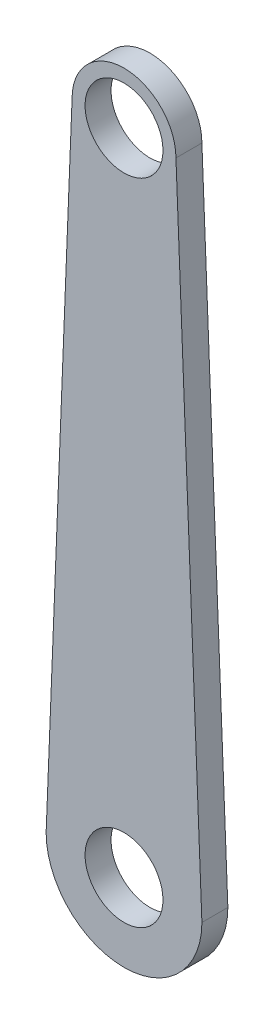
ISO-10303-21;
HEADER;
FILE_DESCRIPTION(('STEP AP214'),'2;1');
FILE_NAME('part.step','',(''),(''),'','','');
FILE_SCHEMA(('AUTOMOTIVE_DESIGN { 1 0 10303 214 1 1 1 1 }'));
ENDSEC;
DATA;
#1=APPLICATION_CONTEXT('core data for automotive mechanical design processes');
#2=APPLICATION_PROTOCOL_DEFINITION('international standard','automotive_design',2000,#1);
#3=PRODUCT_CONTEXT('',#1,'mechanical');
#4=PRODUCT('Part','Part','',(#3));
#5=PRODUCT_RELATED_PRODUCT_CATEGORY('part','',(#4));
#6=PRODUCT_DEFINITION_FORMATION('','',#4);
#7=PRODUCT_DEFINITION_CONTEXT('part definition',#1,'design');
#8=PRODUCT_DEFINITION('design','',#6,#7);
#9=PRODUCT_DEFINITION_SHAPE('','',#8);
#10=(LENGTH_UNIT() NAMED_UNIT(*) SI_UNIT(.MILLI.,.METRE.));
#11=(NAMED_UNIT(*) PLANE_ANGLE_UNIT() SI_UNIT($,.RADIAN.));
#12=(NAMED_UNIT(*) SI_UNIT($,.STERADIAN.) SOLID_ANGLE_UNIT());
#13=UNCERTAINTY_MEASURE_WITH_UNIT(LENGTH_MEASURE(1.E-05),#10,'distance_accuracy_value','');
#14=(GEOMETRIC_REPRESENTATION_CONTEXT(3) GLOBAL_UNCERTAINTY_ASSIGNED_CONTEXT((#13)) GLOBAL_UNIT_ASSIGNED_CONTEXT((#10,
#11,#12)) REPRESENTATION_CONTEXT('',''));
#15=CARTESIAN_POINT('',(0.,0.,0.));
#16=DIRECTION('',(0.,0.,1.));
#17=DIRECTION('',(1.,0.,0.));
#18=AXIS2_PLACEMENT_3D('',#15,#16,#17);
#19=CARTESIAN_POINT('',(8.07772589112119,-0.323109035644848,-2.));
#20=DIRECTION('',(0.999200958721789,-0.0399680383488716,0.));
#21=DIRECTION('',(0.0399680383488716,0.999200958721789,0.));
#22=AXIS2_PLACEMENT_3D('',#19,#20,#21);
#23=PLANE('',#22);
#24=DIRECTION('',(-0.0399680383488716,-0.99920095872179,0.));
#25=VECTOR('',#24,1.);
#26=CARTESIAN_POINT('',(8.07772589112119,-0.323109035644848,0.));
#27=LINE('',#26,#25);
#28=CARTESIAN_POINT('',(8.69089530054577,15.0061261999696,0.));
#29=VERTEX_POINT('',#28);
#30=CARTESIAN_POINT('',(6.69089530054577,-34.9938738000304,0.));
#31=VERTEX_POINT('',#30);
#32=EDGE_CURVE('E111',#29,#31,#27,.T.);
#33=ORIENTED_EDGE('',*,*,#32,.F.);
#34=DIRECTION('',(0.,0.,1.));
#35=VECTOR('',#34,1.);
#36=CARTESIAN_POINT('',(8.69089530054577,15.0061261999696,-2.));
#37=LINE('',#36,#35);
#38=CARTESIAN_POINT('',(8.69089530054577,15.0061261999696,-2.));
#39=VERTEX_POINT('',#38);
#40=EDGE_CURVE('E104',#39,#29,#37,.T.);
#41=ORIENTED_EDGE('',*,*,#40,.F.);
#42=DIRECTION('',(-0.0399680383488716,-0.99920095872179,0.));
#43=VECTOR('',#42,1.);
#44=CARTESIAN_POINT('',(8.07772589112119,-0.323109035644848,-2.));
#45=LINE('',#44,#43);
#46=CARTESIAN_POINT('',(6.69089530054577,-34.9938738000304,-2.));
#47=VERTEX_POINT('',#46);
#48=EDGE_CURVE('E97',#39,#47,#45,.T.);
#49=ORIENTED_EDGE('',*,*,#48,.T.);
#50=DIRECTION('',(0.,0.,1.));
#51=VECTOR('',#50,1.);
#52=CARTESIAN_POINT('',(6.69089530054577,-34.9938738000304,-2.));
#53=LINE('',#52,#51);
#54=EDGE_CURVE('E11',#47,#31,#53,.T.);
#55=ORIENTED_EDGE('',*,*,#54,.T.);
#56=EDGE_LOOP('',(#33,#41,#49,#55));
#57=FACE_BOUND('',#56,.T.);
#58=ADVANCED_FACE('F39',(#57),#23,.F.);
#59=CARTESIAN_POINT('',(12.6908953005458,-34.9938738000304,-2.));
#60=DIRECTION('',(0.,0.,1.));
#61=DIRECTION('',(-1.,0.,0.));
#62=AXIS2_PLACEMENT_3D('',#59,#60,#61);
#63=CYLINDRICAL_SURFACE('',#62,6.);
#64=CARTESIAN_POINT('',(12.6908953005458,-34.9938738000304,0.));
#65=DIRECTION('',(0.,0.,1.));
#66=DIRECTION('',(1.,0.,0.));
#67=AXIS2_PLACEMENT_3D('',#64,#65,#66);
#68=CIRCLE('',#67,6.);
#69=CARTESIAN_POINT('',(18.6908953005458,-34.9938738000304,0.));
#70=VERTEX_POINT('',#69);
#71=EDGE_CURVE('E113',#31,#70,#68,.T.);
#72=ORIENTED_EDGE('',*,*,#71,.F.);
#73=ORIENTED_EDGE('',*,*,#54,.F.);
#74=CARTESIAN_POINT('',(12.6908953005458,-34.9938738000304,-2.));
#75=DIRECTION('',(0.,0.,1.));
#76=DIRECTION('',(1.,0.,0.));
#77=AXIS2_PLACEMENT_3D('',#74,#75,#76);
#78=CIRCLE('',#77,6.);
#79=CARTESIAN_POINT('',(18.6908953005458,-34.9938738000304,-2.));
#80=VERTEX_POINT('',#79);
#81=EDGE_CURVE('E81',#47,#80,#78,.T.);
#82=ORIENTED_EDGE('',*,*,#81,.T.);
#83=DIRECTION('',(0.,0.,1.));
#84=VECTOR('',#83,1.);
#85=CARTESIAN_POINT('',(18.6908953005458,-34.9938738000304,-2.));
#86=LINE('',#85,#84);
#87=EDGE_CURVE('E48',#80,#70,#86,.T.);
#88=ORIENTED_EDGE('',*,*,#87,.T.);
#89=EDGE_LOOP('',(#72,#73,#82,#88));
#90=FACE_BOUND('',#89,.T.);
#91=ADVANCED_FACE('F95',(#90),#63,.T.);
#92=CARTESIAN_POINT('',(17.2635187185948,0.690540748743791,-2.));
#93=DIRECTION('',(0.999200958721789,0.0399680383488715,0.));
#94=DIRECTION('',(-0.0399680383488715,0.999200958721789,0.));
#95=AXIS2_PLACEMENT_3D('',#92,#93,#94);
#96=PLANE('',#95);
#97=DIRECTION('',(0.0399680383488715,-0.99920095872179,0.));
#98=VECTOR('',#97,1.);
#99=CARTESIAN_POINT('',(17.2635187185948,0.690540748743791,0.));
#100=LINE('',#99,#98);
#101=CARTESIAN_POINT('',(16.6908953005458,15.0061261999696,0.));
#102=VERTEX_POINT('',#101);
#103=EDGE_CURVE('E91',#102,#70,#100,.T.);
#104=ORIENTED_EDGE('',*,*,#103,.T.);
#105=ORIENTED_EDGE('',*,*,#87,.F.);
#106=DIRECTION('',(0.0399680383488715,-0.99920095872179,0.));
#107=VECTOR('',#106,1.);
#108=CARTESIAN_POINT('',(17.2635187185948,0.690540748743791,-2.));
#109=LINE('',#108,#107);
#110=CARTESIAN_POINT('',(16.6908953005458,15.0061261999696,-2.));
#111=VERTEX_POINT('',#110);
#112=EDGE_CURVE('E84',#111,#80,#109,.T.);
#113=ORIENTED_EDGE('',*,*,#112,.F.);
#114=DIRECTION('',(0.,0.,1.));
#115=VECTOR('',#114,1.);
#116=CARTESIAN_POINT('',(16.6908953005458,15.0061261999696,-2.));
#117=LINE('',#116,#115);
#118=EDGE_CURVE('E94',#111,#102,#117,.T.);
#119=ORIENTED_EDGE('',*,*,#118,.T.);
#120=EDGE_LOOP('',(#104,#105,#113,#119));
#121=FACE_BOUND('',#120,.T.);
#122=ADVANCED_FACE('F90',(#121),#96,.T.);
#123=CARTESIAN_POINT('',(12.6908953005458,-34.9938738000304,-2.));
#124=DIRECTION('',(0.,0.,1.));
#125=DIRECTION('',(-1.,0.,0.));
#126=AXIS2_PLACEMENT_3D('',#123,#124,#125);
#127=CYLINDRICAL_SURFACE('',#126,3.);
#128=CARTESIAN_POINT('',(12.6908953005458,-34.9938738000304,-2.));
#129=DIRECTION('',(0.,0.,1.));
#130=DIRECTION('',(1.,0.,0.));
#131=AXIS2_PLACEMENT_3D('',#128,#129,#130);
#132=CIRCLE('',#131,3.);
#133=CARTESIAN_POINT('',(15.6908953005458,-34.9938738000304,-2.));
#134=VERTEX_POINT('',#133);
#135=EDGE_CURVE('E99',#134,#134,#132,.T.);
#136=ORIENTED_EDGE('',*,*,#135,.F.);
#137=EDGE_LOOP('',(#136));
#138=FACE_BOUND('',#137,.T.);
#139=CARTESIAN_POINT('',(12.6908953005458,-34.9938738000304,0.));
#140=DIRECTION('',(0.,0.,1.));
#141=DIRECTION('',(1.,0.,0.));
#142=AXIS2_PLACEMENT_3D('',#139,#140,#141);
#143=CIRCLE('',#142,3.);
#144=CARTESIAN_POINT('',(15.6908953005458,-34.9938738000304,0.));
#145=VERTEX_POINT('',#144);
#146=EDGE_CURVE('E108',#145,#145,#143,.T.);
#147=ORIENTED_EDGE('',*,*,#146,.T.);
#148=EDGE_LOOP('',(#147));
#149=FACE_BOUND('',#148,.T.);
#150=ADVANCED_FACE('F132',(#138,#149),#127,.F.);
#151=CARTESIAN_POINT('',(12.6908953005458,15.0061261999696,-2.));
#152=DIRECTION('',(0.,0.,1.));
#153=DIRECTION('',(-1.,0.,0.));
#154=AXIS2_PLACEMENT_3D('',#151,#152,#153);
#155=CYLINDRICAL_SURFACE('',#154,3.);
#156=CARTESIAN_POINT('',(12.6908953005458,15.0061261999696,-2.));
#157=DIRECTION('',(0.,0.,1.));
#158=DIRECTION('',(1.,0.,0.));
#159=AXIS2_PLACEMENT_3D('',#156,#157,#158);
#160=CIRCLE('',#159,3.);
#161=CARTESIAN_POINT('',(15.6908953005458,15.0061261999696,-2.));
#162=VERTEX_POINT('',#161);
#163=EDGE_CURVE('E117',#162,#162,#160,.T.);
#164=ORIENTED_EDGE('',*,*,#163,.F.);
#165=EDGE_LOOP('',(#164));
#166=FACE_BOUND('',#165,.T.);
#167=CARTESIAN_POINT('',(12.6908953005458,15.0061261999696,0.));
#168=DIRECTION('',(0.,0.,1.));
#169=DIRECTION('',(1.,0.,0.));
#170=AXIS2_PLACEMENT_3D('',#167,#168,#169);
#171=CIRCLE('',#170,3.);
#172=CARTESIAN_POINT('',(15.6908953005458,15.0061261999696,0.));
#173=VERTEX_POINT('',#172);
#174=EDGE_CURVE('E105',#173,#173,#171,.T.);
#175=ORIENTED_EDGE('',*,*,#174,.T.);
#176=EDGE_LOOP('',(#175));
#177=FACE_BOUND('',#176,.T.);
#178=ADVANCED_FACE('F41',(#166,#177),#155,.F.);
#179=CARTESIAN_POINT('',(12.6908953005458,15.0061261999696,-2.));
#180=DIRECTION('',(0.,0.,1.));
#181=DIRECTION('',(-1.,0.,0.));
#182=AXIS2_PLACEMENT_3D('',#179,#180,#181);
#183=CYLINDRICAL_SURFACE('',#182,4.);
#184=CARTESIAN_POINT('',(12.6908953005458,15.0061261999696,0.));
#185=DIRECTION('',(0.,0.,1.));
#186=DIRECTION('',(1.,0.,0.));
#187=AXIS2_PLACEMENT_3D('',#184,#185,#186);
#188=CIRCLE('',#187,4.);
#189=EDGE_CURVE('E70',#102,#29,#188,.T.);
#190=ORIENTED_EDGE('',*,*,#189,.F.);
#191=ORIENTED_EDGE('',*,*,#118,.F.);
#192=CARTESIAN_POINT('',(12.6908953005458,15.0061261999696,-2.));
#193=DIRECTION('',(0.,0.,1.));
#194=DIRECTION('',(1.,0.,0.));
#195=AXIS2_PLACEMENT_3D('',#192,#193,#194);
#196=CIRCLE('',#195,4.);
#197=EDGE_CURVE('E56',#111,#39,#196,.T.);
#198=ORIENTED_EDGE('',*,*,#197,.T.);
#199=ORIENTED_EDGE('',*,*,#40,.T.);
#200=EDGE_LOOP('',(#190,#191,#198,#199));
#201=FACE_BOUND('',#200,.T.);
#202=ADVANCED_FACE('F123',(#201),#183,.T.);
#203=CARTESIAN_POINT('',(0.,0.,-2.));
#204=DIRECTION('',(0.,0.,-1.));
#205=DIRECTION('',(1.,0.,0.));
#206=AXIS2_PLACEMENT_3D('',#203,#204,#205);
#207=PLANE('',#206);
#208=ORIENTED_EDGE('',*,*,#163,.T.);
#209=EDGE_LOOP('',(#208));
#210=FACE_BOUND('',#209,.T.);
#211=ORIENTED_EDGE('',*,*,#135,.T.);
#212=EDGE_LOOP('',(#211));
#213=FACE_BOUND('',#212,.T.);
#214=ORIENTED_EDGE('',*,*,#48,.F.);
#215=ORIENTED_EDGE('',*,*,#197,.F.);
#216=ORIENTED_EDGE('',*,*,#112,.T.);
#217=ORIENTED_EDGE('',*,*,#81,.F.);
#218=EDGE_LOOP('',(#214,#215,#216,#217));
#219=FACE_BOUND('',#218,.T.);
#220=ADVANCED_FACE('F86',(#210,#213,#219),#207,.T.);
#221=CARTESIAN_POINT('',(0.,0.,0.));
#222=DIRECTION('',(0.,0.,-1.));
#223=DIRECTION('',(1.,0.,0.));
#224=AXIS2_PLACEMENT_3D('',#221,#222,#223);
#225=PLANE('',#224);
#226=ORIENTED_EDGE('',*,*,#174,.F.);
#227=EDGE_LOOP('',(#226));
#228=FACE_BOUND('',#227,.T.);
#229=ORIENTED_EDGE('',*,*,#146,.F.);
#230=EDGE_LOOP('',(#229));
#231=FACE_BOUND('',#230,.T.);
#232=ORIENTED_EDGE('',*,*,#32,.T.);
#233=ORIENTED_EDGE('',*,*,#71,.T.);
#234=ORIENTED_EDGE('',*,*,#103,.F.);
#235=ORIENTED_EDGE('',*,*,#189,.T.);
#236=EDGE_LOOP('',(#232,#233,#234,#235));
#237=FACE_BOUND('',#236,.T.);
#238=ADVANCED_FACE('F119',(#228,#231,#237),#225,.F.);
#239=CLOSED_SHELL('',(#58,#91,#122,#150,#178,#202,#220,#238));
#240=MANIFOLD_SOLID_BREP('B2',#239);
#241=ADVANCED_BREP_SHAPE_REPRESENTATION('',(#18,#240),#14);
#242=SHAPE_DEFINITION_REPRESENTATION(#9,#241);
ENDSEC;
END-ISO-10303-21;
